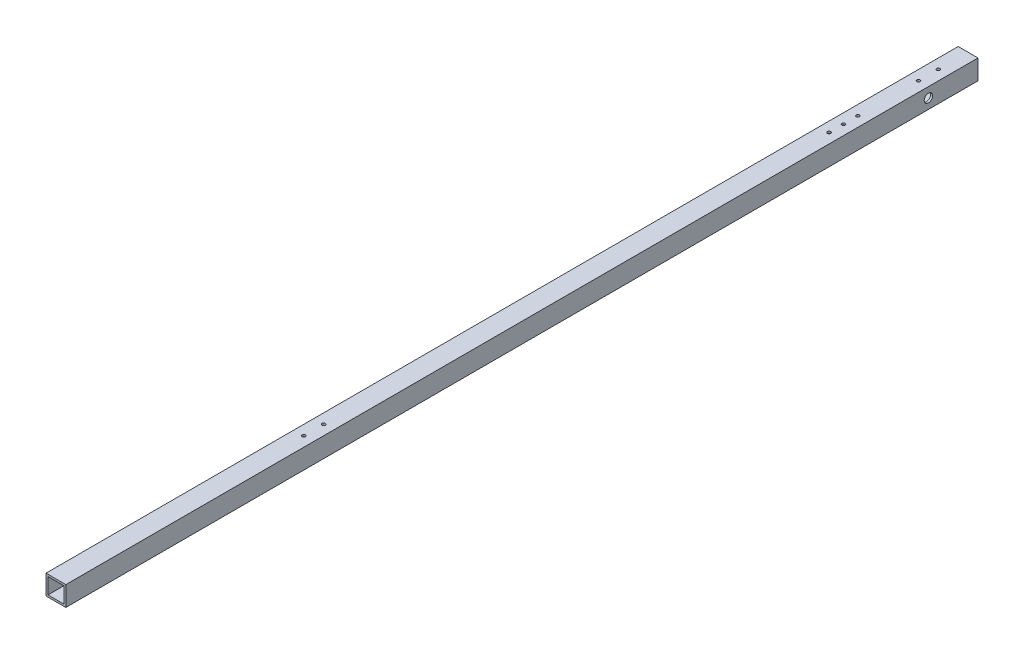
ISO-10303-21;
HEADER;
FILE_DESCRIPTION(('STEP AP214'),'2;1');
FILE_NAME('part.step','',(''),(''),'','','');
FILE_SCHEMA(('AUTOMOTIVE_DESIGN { 1 0 10303 214 1 1 1 1 }'));
ENDSEC;
DATA;
#1=APPLICATION_CONTEXT('core data for automotive mechanical design processes');
#2=APPLICATION_PROTOCOL_DEFINITION('international standard','automotive_design',2000,#1);
#3=PRODUCT_CONTEXT('',#1,'mechanical');
#4=PRODUCT('Part','Part','',(#3));
#5=PRODUCT_RELATED_PRODUCT_CATEGORY('part','',(#4));
#6=PRODUCT_DEFINITION_FORMATION('','',#4);
#7=PRODUCT_DEFINITION_CONTEXT('part definition',#1,'design');
#8=PRODUCT_DEFINITION('design','',#6,#7);
#9=PRODUCT_DEFINITION_SHAPE('','',#8);
#10=(LENGTH_UNIT() NAMED_UNIT(*) SI_UNIT(.MILLI.,.METRE.));
#11=(NAMED_UNIT(*) PLANE_ANGLE_UNIT() SI_UNIT($,.RADIAN.));
#12=(NAMED_UNIT(*) SI_UNIT($,.STERADIAN.) SOLID_ANGLE_UNIT());
#13=UNCERTAINTY_MEASURE_WITH_UNIT(LENGTH_MEASURE(1.E-05),#10,'distance_accuracy_value','');
#14=(GEOMETRIC_REPRESENTATION_CONTEXT(3) GLOBAL_UNCERTAINTY_ASSIGNED_CONTEXT((#13)) GLOBAL_UNIT_ASSIGNED_CONTEXT((#10,
#11,#12)) REPRESENTATION_CONTEXT('',''));
#15=CARTESIAN_POINT('',(0.,0.,0.));
#16=DIRECTION('',(0.,0.,1.));
#17=DIRECTION('',(1.,0.,0.));
#18=AXIS2_PLACEMENT_3D('',#15,#16,#17);
#19=CARTESIAN_POINT('',(-10.,10.,970.));
#20=DIRECTION('',(1.,0.,0.));
#21=DIRECTION('',(0.,0.,-1.));
#22=AXIS2_PLACEMENT_3D('',#19,#20,#21);
#23=PLANE('',#22);
#24=CARTESIAN_POINT('',(-10.,0.,730.));
#25=DIRECTION('',(-1.,0.,0.));
#26=DIRECTION('',(0.,0.,1.));
#27=AXIS2_PLACEMENT_3D('',#24,#25,#26);
#28=CIRCLE('',#27,1.64999999999999);
#29=CARTESIAN_POINT('',(-10.,0.,731.65));
#30=VERTEX_POINT('',#29);
#31=EDGE_CURVE('E362',#30,#30,#28,.T.);
#32=ORIENTED_EDGE('',*,*,#31,.F.);
#33=EDGE_LOOP('',(#32));
#34=FACE_BOUND('',#33,.T.);
#35=CARTESIAN_POINT('',(-10.,0.,710.));
#36=DIRECTION('',(-1.,0.,0.));
#37=DIRECTION('',(0.,0.,1.));
#38=AXIS2_PLACEMENT_3D('',#35,#36,#37);
#39=CIRCLE('',#38,1.64999999999999);
#40=CARTESIAN_POINT('',(-10.,0.,711.65));
#41=VERTEX_POINT('',#40);
#42=EDGE_CURVE('E356',#41,#41,#39,.T.);
#43=ORIENTED_EDGE('',*,*,#42,.F.);
#44=EDGE_LOOP('',(#43));
#45=FACE_BOUND('',#44,.T.);
#46=DIRECTION('',(0.,-1.,0.));
#47=VECTOR('',#46,1.);
#48=CARTESIAN_POINT('',(-10.,10.,920.));
#49=LINE('',#48,#47);
#50=CARTESIAN_POINT('',(-10.,10.,920.));
#51=VERTEX_POINT('',#50);
#52=CARTESIAN_POINT('',(-10.,-10.,920.));
#53=VERTEX_POINT('',#52);
#54=EDGE_CURVE('E60',#51,#53,#49,.T.);
#55=ORIENTED_EDGE('',*,*,#54,.F.);
#56=DIRECTION('',(0.,0.,-1.));
#57=VECTOR('',#56,1.);
#58=CARTESIAN_POINT('',(-10.,10.,970.));
#59=LINE('',#58,#57);
#60=CARTESIAN_POINT('',(-10.,10.,0.));
#61=VERTEX_POINT('',#60);
#62=EDGE_CURVE('E151',#51,#61,#59,.T.);
#63=ORIENTED_EDGE('',*,*,#62,.T.);
#64=DIRECTION('',(0.,-1.,0.));
#65=VECTOR('',#64,1.);
#66=CARTESIAN_POINT('',(-10.,10.,0.));
#67=LINE('',#66,#65);
#68=CARTESIAN_POINT('',(-10.,-10.,0.));
#69=VERTEX_POINT('',#68);
#70=EDGE_CURVE('E141',#61,#69,#67,.T.);
#71=ORIENTED_EDGE('',*,*,#70,.T.);
#72=DIRECTION('',(0.,0.,-1.));
#73=VECTOR('',#72,1.);
#74=CARTESIAN_POINT('',(-10.,-10.,970.));
#75=LINE('',#74,#73);
#76=EDGE_CURVE('E149',#53,#69,#75,.T.);
#77=ORIENTED_EDGE('',*,*,#76,.F.);
#78=EDGE_LOOP('',(#55,#63,#71,#77));
#79=FACE_BOUND('',#78,.T.);
#80=CARTESIAN_POINT('',(-10.,0.,49.9999999999999));
#81=DIRECTION('',(1.,0.,0.));
#82=DIRECTION('',(0.,0.,-1.));
#83=AXIS2_PLACEMENT_3D('',#80,#81,#82);
#84=CIRCLE('',#83,4.25000000000001);
#85=CARTESIAN_POINT('',(-10.,0.,45.7499999999999));
#86=VERTEX_POINT('',#85);
#87=EDGE_CURVE('E157',#86,#86,#84,.T.);
#88=ORIENTED_EDGE('',*,*,#87,.T.);
#89=EDGE_LOOP('',(#88));
#90=FACE_BOUND('',#89,.T.);
#91=CARTESIAN_POINT('',(-10.,0.,40.));
#92=DIRECTION('',(-1.,0.,0.));
#93=DIRECTION('',(0.,0.,1.));
#94=AXIS2_PLACEMENT_3D('',#91,#92,#93);
#95=CIRCLE('',#94,1.64999999999999);
#96=CARTESIAN_POINT('',(-10.,0.,41.65));
#97=VERTEX_POINT('',#96);
#98=EDGE_CURVE('E353',#97,#97,#95,.T.);
#99=ORIENTED_EDGE('',*,*,#98,.F.);
#100=EDGE_LOOP('',(#99));
#101=FACE_BOUND('',#100,.T.);
#102=ADVANCED_FACE('F43',(#34,#45,#79,#90,#101),#23,.F.);
#103=CARTESIAN_POINT('',(10.,10.,970.));
#104=DIRECTION('',(-1.,0.,0.));
#105=DIRECTION('',(0.,0.,1.));
#106=AXIS2_PLACEMENT_3D('',#103,#104,#105);
#107=PLANE('',#106);
#108=CARTESIAN_POINT('',(10.,0.,49.9999999999999));
#109=DIRECTION('',(1.,0.,0.));
#110=DIRECTION('',(0.,0.,-1.));
#111=AXIS2_PLACEMENT_3D('',#108,#109,#110);
#112=CIRCLE('',#111,4.25000000000001);
#113=CARTESIAN_POINT('',(10.,0.,45.7499999999999));
#114=VERTEX_POINT('',#113);
#115=EDGE_CURVE('E228',#114,#114,#112,.T.);
#116=ORIENTED_EDGE('',*,*,#115,.F.);
#117=EDGE_LOOP('',(#116));
#118=FACE_BOUND('',#117,.T.);
#119=DIRECTION('',(0.,1.,0.));
#120=VECTOR('',#119,1.);
#121=CARTESIAN_POINT('',(10.,10.,920.));
#122=LINE('',#121,#120);
#123=CARTESIAN_POINT('',(10.,-10.,920.));
#124=VERTEX_POINT('',#123);
#125=CARTESIAN_POINT('',(10.,10.,920.));
#126=VERTEX_POINT('',#125);
#127=EDGE_CURVE('E226',#124,#126,#122,.T.);
#128=ORIENTED_EDGE('',*,*,#127,.F.);
#129=DIRECTION('',(0.,0.,-1.));
#130=VECTOR('',#129,1.);
#131=CARTESIAN_POINT('',(10.,-10.,970.));
#132=LINE('',#131,#130);
#133=CARTESIAN_POINT('',(10.,-10.,0.));
#134=VERTEX_POINT('',#133);
#135=EDGE_CURVE('E147',#124,#134,#132,.T.);
#136=ORIENTED_EDGE('',*,*,#135,.T.);
#137=DIRECTION('',(0.,1.,0.));
#138=VECTOR('',#137,1.);
#139=CARTESIAN_POINT('',(10.,10.,0.));
#140=LINE('',#139,#138);
#141=CARTESIAN_POINT('',(10.,10.,0.));
#142=VERTEX_POINT('',#141);
#143=EDGE_CURVE('E135',#134,#142,#140,.T.);
#144=ORIENTED_EDGE('',*,*,#143,.T.);
#145=DIRECTION('',(0.,0.,-1.));
#146=VECTOR('',#145,1.);
#147=CARTESIAN_POINT('',(10.,10.,970.));
#148=LINE('',#147,#146);
#149=EDGE_CURVE('E52',#126,#142,#148,.T.);
#150=ORIENTED_EDGE('',*,*,#149,.F.);
#151=EDGE_LOOP('',(#128,#136,#144,#150));
#152=FACE_BOUND('',#151,.T.);
#153=ADVANCED_FACE('F45',(#118,#152),#107,.F.);
#154=CARTESIAN_POINT('',(-10.,10.,970.));
#155=DIRECTION('',(0.,-1.,0.));
#156=DIRECTION('',(1.,0.,0.));
#157=AXIS2_PLACEMENT_3D('',#154,#155,#156);
#158=PLANE('',#157);
#159=CARTESIAN_POINT('',(0.,10.,30.));
#160=DIRECTION('',(0.,1.,0.));
#161=DIRECTION('',(0.,0.,1.));
#162=AXIS2_PLACEMENT_3D('',#159,#160,#161);
#163=CIRCLE('',#162,1.64999999999999);
#164=CARTESIAN_POINT('',(0.,10.,31.65));
#165=VERTEX_POINT('',#164);
#166=EDGE_CURVE('E186',#165,#165,#163,.T.);
#167=ORIENTED_EDGE('',*,*,#166,.F.);
#168=EDGE_LOOP('',(#167));
#169=FACE_BOUND('',#168,.T.);
#170=CARTESIAN_POINT('',(0.,10.,50.));
#171=DIRECTION('',(0.,1.,0.));
#172=DIRECTION('',(0.,0.,1.));
#173=AXIS2_PLACEMENT_3D('',#170,#171,#172);
#174=CIRCLE('',#173,1.64999999999999);
#175=CARTESIAN_POINT('',(0.,10.,51.65));
#176=VERTEX_POINT('',#175);
#177=EDGE_CURVE('E175',#176,#176,#174,.T.);
#178=ORIENTED_EDGE('',*,*,#177,.F.);
#179=EDGE_LOOP('',(#178));
#180=FACE_BOUND('',#179,.T.);
#181=CARTESIAN_POINT('',(0.,10.,650.));
#182=DIRECTION('',(0.,1.,0.));
#183=DIRECTION('',(0.,0.,1.));
#184=AXIS2_PLACEMENT_3D('',#181,#182,#183);
#185=CIRCLE('',#184,1.64999999999999);
#186=CARTESIAN_POINT('',(0.,10.,651.65));
#187=VERTEX_POINT('',#186);
#188=EDGE_CURVE('E174',#187,#187,#185,.T.);
#189=ORIENTED_EDGE('',*,*,#188,.F.);
#190=EDGE_LOOP('',(#189));
#191=FACE_BOUND('',#190,.T.);
#192=CARTESIAN_POINT('',(0.,10.,670.));
#193=DIRECTION('',(0.,1.,0.));
#194=DIRECTION('',(0.,0.,1.));
#195=AXIS2_PLACEMENT_3D('',#192,#193,#194);
#196=CIRCLE('',#195,1.64999999999999);
#197=CARTESIAN_POINT('',(0.,10.,671.65));
#198=VERTEX_POINT('',#197);
#199=EDGE_CURVE('E171',#198,#198,#196,.T.);
#200=ORIENTED_EDGE('',*,*,#199,.F.);
#201=EDGE_LOOP('',(#200));
#202=FACE_BOUND('',#201,.T.);
#203=CARTESIAN_POINT('',(0.,10.,125.71));
#204=DIRECTION('',(0.,1.,0.));
#205=DIRECTION('',(0.,0.,1.));
#206=AXIS2_PLACEMENT_3D('',#203,#204,#205);
#207=CIRCLE('',#206,1.64999999999999);
#208=CARTESIAN_POINT('',(0.,10.,127.36));
#209=VERTEX_POINT('',#208);
#210=EDGE_CURVE('E170',#209,#209,#207,.T.);
#211=ORIENTED_EDGE('',*,*,#210,.F.);
#212=EDGE_LOOP('',(#211));
#213=FACE_BOUND('',#212,.T.);
#214=CARTESIAN_POINT('',(0.,10.,111.21));
#215=DIRECTION('',(0.,1.,0.));
#216=DIRECTION('',(0.,0.,1.));
#217=AXIS2_PLACEMENT_3D('',#214,#215,#216);
#218=CIRCLE('',#217,1.64999999999999);
#219=CARTESIAN_POINT('',(0.,10.,112.86));
#220=VERTEX_POINT('',#219);
#221=EDGE_CURVE('E205',#220,#220,#218,.T.);
#222=ORIENTED_EDGE('',*,*,#221,.F.);
#223=EDGE_LOOP('',(#222));
#224=FACE_BOUND('',#223,.T.);
#225=CARTESIAN_POINT('',(0.,10.,140.21));
#226=DIRECTION('',(0.,1.,0.));
#227=DIRECTION('',(0.,0.,1.));
#228=AXIS2_PLACEMENT_3D('',#225,#226,#227);
#229=CIRCLE('',#228,1.64999999999999);
#230=CARTESIAN_POINT('',(0.,10.,141.86));
#231=VERTEX_POINT('',#230);
#232=EDGE_CURVE('E212',#231,#231,#229,.T.);
#233=ORIENTED_EDGE('',*,*,#232,.F.);
#234=EDGE_LOOP('',(#233));
#235=FACE_BOUND('',#234,.T.);
#236=DIRECTION('',(-1.,0.,0.));
#237=VECTOR('',#236,1.);
#238=CARTESIAN_POINT('',(-10.,10.,920.));
#239=LINE('',#238,#237);
#240=EDGE_CURVE('E224',#126,#51,#239,.T.);
#241=ORIENTED_EDGE('',*,*,#240,.F.);
#242=ORIENTED_EDGE('',*,*,#149,.T.);
#243=DIRECTION('',(-1.,0.,0.));
#244=VECTOR('',#243,1.);
#245=CARTESIAN_POINT('',(-10.,10.,0.));
#246=LINE('',#245,#244);
#247=EDGE_CURVE('E138',#142,#61,#246,.T.);
#248=ORIENTED_EDGE('',*,*,#247,.T.);
#249=ORIENTED_EDGE('',*,*,#62,.F.);
#250=EDGE_LOOP('',(#241,#242,#248,#249));
#251=FACE_BOUND('',#250,.T.);
#252=ADVANCED_FACE('F261',(#169,#180,#191,#202,#213,#224,#235,#251),#158,.F.);
#253=CARTESIAN_POINT('',(-10.,-10.,970.));
#254=DIRECTION('',(0.,1.,0.));
#255=DIRECTION('',(0.,0.,1.));
#256=AXIS2_PLACEMENT_3D('',#253,#254,#255);
#257=PLANE('',#256);
#258=CARTESIAN_POINT('',(0.,-10.,125.71));
#259=DIRECTION('',(0.,1.,0.));
#260=DIRECTION('',(0.,0.,1.));
#261=AXIS2_PLACEMENT_3D('',#258,#259,#260);
#262=CIRCLE('',#261,1.65);
#263=CARTESIAN_POINT('',(0.,-10.,127.36));
#264=VERTEX_POINT('',#263);
#265=EDGE_CURVE('E196',#264,#264,#262,.T.);
#266=ORIENTED_EDGE('',*,*,#265,.T.);
#267=EDGE_LOOP('',(#266));
#268=FACE_BOUND('',#267,.T.);
#269=CARTESIAN_POINT('',(0.,-10.,111.21));
#270=DIRECTION('',(0.,1.,0.));
#271=DIRECTION('',(0.,0.,1.));
#272=AXIS2_PLACEMENT_3D('',#269,#270,#271);
#273=CIRCLE('',#272,1.65);
#274=CARTESIAN_POINT('',(0.,-10.,112.86));
#275=VERTEX_POINT('',#274);
#276=EDGE_CURVE('E167',#275,#275,#273,.T.);
#277=ORIENTED_EDGE('',*,*,#276,.T.);
#278=EDGE_LOOP('',(#277));
#279=FACE_BOUND('',#278,.T.);
#280=CARTESIAN_POINT('',(0.,-10.,140.21));
#281=DIRECTION('',(0.,1.,0.));
#282=DIRECTION('',(0.,0.,1.));
#283=AXIS2_PLACEMENT_3D('',#280,#281,#282);
#284=CIRCLE('',#283,1.65);
#285=CARTESIAN_POINT('',(0.,-10.,141.86));
#286=VERTEX_POINT('',#285);
#287=EDGE_CURVE('E162',#286,#286,#284,.T.);
#288=ORIENTED_EDGE('',*,*,#287,.T.);
#289=EDGE_LOOP('',(#288));
#290=FACE_BOUND('',#289,.T.);
#291=DIRECTION('',(1.,0.,0.));
#292=VECTOR('',#291,1.);
#293=CARTESIAN_POINT('',(-10.,-10.,920.));
#294=LINE('',#293,#292);
#295=EDGE_CURVE('E221',#53,#124,#294,.T.);
#296=ORIENTED_EDGE('',*,*,#295,.F.);
#297=ORIENTED_EDGE('',*,*,#76,.T.);
#298=DIRECTION('',(1.,0.,0.));
#299=VECTOR('',#298,1.);
#300=CARTESIAN_POINT('',(-10.,-10.,0.));
#301=LINE('',#300,#299);
#302=EDGE_CURVE('E144',#69,#134,#301,.T.);
#303=ORIENTED_EDGE('',*,*,#302,.T.);
#304=ORIENTED_EDGE('',*,*,#135,.F.);
#305=EDGE_LOOP('',(#296,#297,#303,#304));
#306=FACE_BOUND('',#305,.T.);
#307=ADVANCED_FACE('F252',(#268,#279,#290,#306),#257,.F.);
#308=CARTESIAN_POINT('',(8.,8.,970.));
#309=DIRECTION('',(-1.,0.,0.));
#310=DIRECTION('',(0.,-1.,0.));
#311=AXIS2_PLACEMENT_3D('',#308,#309,#310);
#312=PLANE('',#311);
#313=CARTESIAN_POINT('',(8.,0.,49.9999999999999));
#314=DIRECTION('',(-1.,0.,0.));
#315=DIRECTION('',(0.,-1.,0.));
#316=AXIS2_PLACEMENT_3D('',#313,#314,#315);
#317=CIRCLE('',#316,4.25000000000001);
#318=CARTESIAN_POINT('',(8.,-4.25000000000001,49.9999999999999));
#319=VERTEX_POINT('',#318);
#320=EDGE_CURVE('E156',#319,#319,#317,.T.);
#321=ORIENTED_EDGE('',*,*,#320,.F.);
#322=EDGE_LOOP('',(#321));
#323=FACE_BOUND('',#322,.T.);
#324=DIRECTION('',(0.,0.,-1.));
#325=VECTOR('',#324,1.);
#326=CARTESIAN_POINT('',(8.,-8.,970.));
#327=LINE('',#326,#325);
#328=CARTESIAN_POINT('',(8.,-8.,920.));
#329=VERTEX_POINT('',#328);
#330=CARTESIAN_POINT('',(8.,-8.,0.));
#331=VERTEX_POINT('',#330);
#332=EDGE_CURVE('E127',#329,#331,#327,.T.);
#333=ORIENTED_EDGE('',*,*,#332,.F.);
#334=DIRECTION('',(0.,1.,0.));
#335=VECTOR('',#334,1.);
#336=CARTESIAN_POINT('',(8.,8.,920.));
#337=LINE('',#336,#335);
#338=CARTESIAN_POINT('',(8.,8.,920.));
#339=VERTEX_POINT('',#338);
#340=EDGE_CURVE('E68',#329,#339,#337,.T.);
#341=ORIENTED_EDGE('',*,*,#340,.T.);
#342=DIRECTION('',(0.,0.,-1.));
#343=VECTOR('',#342,1.);
#344=CARTESIAN_POINT('',(8.,8.,970.));
#345=LINE('',#344,#343);
#346=CARTESIAN_POINT('',(8.,8.,0.));
#347=VERTEX_POINT('',#346);
#348=EDGE_CURVE('E129',#339,#347,#345,.T.);
#349=ORIENTED_EDGE('',*,*,#348,.T.);
#350=DIRECTION('',(0.,1.,0.));
#351=VECTOR('',#350,1.);
#352=CARTESIAN_POINT('',(8.,8.,0.));
#353=LINE('',#352,#351);
#354=EDGE_CURVE('E235',#331,#347,#353,.T.);
#355=ORIENTED_EDGE('',*,*,#354,.F.);
#356=EDGE_LOOP('',(#333,#341,#349,#355));
#357=FACE_BOUND('',#356,.T.);
#358=ADVANCED_FACE('F250',(#323,#357),#312,.T.);
#359=CARTESIAN_POINT('',(-8.,8.,970.));
#360=DIRECTION('',(0.,-1.,0.));
#361=DIRECTION('',(0.,0.,-1.));
#362=AXIS2_PLACEMENT_3D('',#359,#360,#361);
#363=PLANE('',#362);
#364=CARTESIAN_POINT('',(0.,8.,30.));
#365=DIRECTION('',(0.,-1.,0.));
#366=DIRECTION('',(0.,0.,-1.));
#367=AXIS2_PLACEMENT_3D('',#364,#365,#366);
#368=CIRCLE('',#367,1.64999999999999);
#369=CARTESIAN_POINT('',(0.,8.,28.35));
#370=VERTEX_POINT('',#369);
#371=EDGE_CURVE('E47',#370,#370,#368,.T.);
#372=ORIENTED_EDGE('',*,*,#371,.F.);
#373=EDGE_LOOP('',(#372));
#374=FACE_BOUND('',#373,.T.);
#375=CARTESIAN_POINT('',(0.,8.,50.));
#376=DIRECTION('',(0.,-1.,0.));
#377=DIRECTION('',(0.,0.,-1.));
#378=AXIS2_PLACEMENT_3D('',#375,#376,#377);
#379=CIRCLE('',#378,1.64999999999999);
#380=CARTESIAN_POINT('',(0.,8.,48.35));
#381=VERTEX_POINT('',#380);
#382=EDGE_CURVE('E172',#381,#381,#379,.T.);
#383=ORIENTED_EDGE('',*,*,#382,.F.);
#384=EDGE_LOOP('',(#383));
#385=FACE_BOUND('',#384,.T.);
#386=CARTESIAN_POINT('',(0.,8.,650.));
#387=DIRECTION('',(0.,-1.,0.));
#388=DIRECTION('',(0.,0.,-1.));
#389=AXIS2_PLACEMENT_3D('',#386,#387,#388);
#390=CIRCLE('',#389,1.64999999999999);
#391=CARTESIAN_POINT('',(0.,8.,648.35));
#392=VERTEX_POINT('',#391);
#393=EDGE_CURVE('E179',#392,#392,#390,.T.);
#394=ORIENTED_EDGE('',*,*,#393,.F.);
#395=EDGE_LOOP('',(#394));
#396=FACE_BOUND('',#395,.T.);
#397=CARTESIAN_POINT('',(0.,8.,670.));
#398=DIRECTION('',(0.,-1.,0.));
#399=DIRECTION('',(0.,0.,-1.));
#400=AXIS2_PLACEMENT_3D('',#397,#398,#399);
#401=CIRCLE('',#400,1.64999999999999);
#402=CARTESIAN_POINT('',(0.,8.,668.35));
#403=VERTEX_POINT('',#402);
#404=EDGE_CURVE('E168',#403,#403,#401,.T.);
#405=ORIENTED_EDGE('',*,*,#404,.F.);
#406=EDGE_LOOP('',(#405));
#407=FACE_BOUND('',#406,.T.);
#408=CARTESIAN_POINT('',(0.,8.,125.71));
#409=DIRECTION('',(0.,-1.,0.));
#410=DIRECTION('',(0.,0.,-1.));
#411=AXIS2_PLACEMENT_3D('',#408,#409,#410);
#412=CIRCLE('',#411,1.64999999999999);
#413=CARTESIAN_POINT('',(0.,8.,124.06));
#414=VERTEX_POINT('',#413);
#415=EDGE_CURVE('E202',#414,#414,#412,.T.);
#416=ORIENTED_EDGE('',*,*,#415,.F.);
#417=EDGE_LOOP('',(#416));
#418=FACE_BOUND('',#417,.T.);
#419=CARTESIAN_POINT('',(0.,8.,111.21));
#420=DIRECTION('',(0.,-1.,0.));
#421=DIRECTION('',(0.,0.,-1.));
#422=AXIS2_PLACEMENT_3D('',#419,#420,#421);
#423=CIRCLE('',#422,1.64999999999999);
#424=CARTESIAN_POINT('',(0.,8.,109.56));
#425=VERTEX_POINT('',#424);
#426=EDGE_CURVE('E163',#425,#425,#423,.T.);
#427=ORIENTED_EDGE('',*,*,#426,.F.);
#428=EDGE_LOOP('',(#427));
#429=FACE_BOUND('',#428,.T.);
#430=CARTESIAN_POINT('',(0.,8.,140.21));
#431=DIRECTION('',(0.,-1.,0.));
#432=DIRECTION('',(0.,0.,-1.));
#433=AXIS2_PLACEMENT_3D('',#430,#431,#432);
#434=CIRCLE('',#433,1.64999999999999);
#435=CARTESIAN_POINT('',(0.,8.,138.56));
#436=VERTEX_POINT('',#435);
#437=EDGE_CURVE('E159',#436,#436,#434,.T.);
#438=ORIENTED_EDGE('',*,*,#437,.F.);
#439=EDGE_LOOP('',(#438));
#440=FACE_BOUND('',#439,.T.);
#441=ORIENTED_EDGE('',*,*,#348,.F.);
#442=DIRECTION('',(-1.,0.,0.));
#443=VECTOR('',#442,1.);
#444=CARTESIAN_POINT('',(-8.,8.,920.));
#445=LINE('',#444,#443);
#446=CARTESIAN_POINT('',(-8.,8.,920.));
#447=VERTEX_POINT('',#446);
#448=EDGE_CURVE('E120',#339,#447,#445,.T.);
#449=ORIENTED_EDGE('',*,*,#448,.T.);
#450=DIRECTION('',(0.,0.,-1.));
#451=VECTOR('',#450,1.);
#452=CARTESIAN_POINT('',(-8.,8.,970.));
#453=LINE('',#452,#451);
#454=CARTESIAN_POINT('',(-8.,8.,0.));
#455=VERTEX_POINT('',#454);
#456=EDGE_CURVE('E119',#447,#455,#453,.T.);
#457=ORIENTED_EDGE('',*,*,#456,.T.);
#458=DIRECTION('',(-1.,0.,0.));
#459=VECTOR('',#458,1.);
#460=CARTESIAN_POINT('',(-8.,8.,0.));
#461=LINE('',#460,#459);
#462=EDGE_CURVE('E238',#347,#455,#461,.T.);
#463=ORIENTED_EDGE('',*,*,#462,.F.);
#464=EDGE_LOOP('',(#441,#449,#457,#463));
#465=FACE_BOUND('',#464,.T.);
#466=ADVANCED_FACE('F248',(#374,#385,#396,#407,#418,#429,#440,#465),#363,.T.);
#467=CARTESIAN_POINT('',(-8.,8.,970.));
#468=DIRECTION('',(1.,0.,0.));
#469=DIRECTION('',(0.,0.,-1.));
#470=AXIS2_PLACEMENT_3D('',#467,#468,#469);
#471=PLANE('',#470);
#472=CARTESIAN_POINT('',(-8.,0.,730.));
#473=DIRECTION('',(1.,0.,0.));
#474=DIRECTION('',(0.,0.,-1.));
#475=AXIS2_PLACEMENT_3D('',#472,#473,#474);
#476=CIRCLE('',#475,1.64999999999999);
#477=CARTESIAN_POINT('',(-8.,0.,728.35));
#478=VERTEX_POINT('',#477);
#479=EDGE_CURVE('E338',#478,#478,#476,.T.);
#480=ORIENTED_EDGE('',*,*,#479,.F.);
#481=EDGE_LOOP('',(#480));
#482=FACE_BOUND('',#481,.T.);
#483=CARTESIAN_POINT('',(-8.,0.,710.));
#484=DIRECTION('',(1.,0.,0.));
#485=DIRECTION('',(0.,0.,-1.));
#486=AXIS2_PLACEMENT_3D('',#483,#484,#485);
#487=CIRCLE('',#486,1.64999999999999);
#488=CARTESIAN_POINT('',(-8.,0.,708.35));
#489=VERTEX_POINT('',#488);
#490=EDGE_CURVE('E342',#489,#489,#487,.T.);
#491=ORIENTED_EDGE('',*,*,#490,.F.);
#492=EDGE_LOOP('',(#491));
#493=FACE_BOUND('',#492,.T.);
#494=CARTESIAN_POINT('',(-8.,0.,40.));
#495=DIRECTION('',(1.,0.,0.));
#496=DIRECTION('',(0.,0.,-1.));
#497=AXIS2_PLACEMENT_3D('',#494,#495,#496);
#498=CIRCLE('',#497,1.64999999999999);
#499=CARTESIAN_POINT('',(-8.,0.,38.35));
#500=VERTEX_POINT('',#499);
#501=EDGE_CURVE('E346',#500,#500,#498,.T.);
#502=ORIENTED_EDGE('',*,*,#501,.F.);
#503=EDGE_LOOP('',(#502));
#504=FACE_BOUND('',#503,.T.);
#505=CARTESIAN_POINT('',(-8.,0.,49.9999999999999));
#506=DIRECTION('',(1.,0.,0.));
#507=DIRECTION('',(0.,0.,-1.));
#508=AXIS2_PLACEMENT_3D('',#505,#506,#507);
#509=CIRCLE('',#508,4.25000000000001);
#510=CARTESIAN_POINT('',(-8.,0.,45.7499999999999));
#511=VERTEX_POINT('',#510);
#512=EDGE_CURVE('E154',#511,#511,#509,.T.);
#513=ORIENTED_EDGE('',*,*,#512,.F.);
#514=EDGE_LOOP('',(#513));
#515=FACE_BOUND('',#514,.T.);
#516=ORIENTED_EDGE('',*,*,#456,.F.);
#517=DIRECTION('',(0.,-1.,0.));
#518=VECTOR('',#517,1.);
#519=CARTESIAN_POINT('',(-8.,8.,920.));
#520=LINE('',#519,#518);
#521=CARTESIAN_POINT('',(-8.,-8.,920.));
#522=VERTEX_POINT('',#521);
#523=EDGE_CURVE('E108',#447,#522,#520,.T.);
#524=ORIENTED_EDGE('',*,*,#523,.T.);
#525=DIRECTION('',(0.,0.,-1.));
#526=VECTOR('',#525,1.);
#527=CARTESIAN_POINT('',(-8.,-8.,970.));
#528=LINE('',#527,#526);
#529=CARTESIAN_POINT('',(-8.,-8.,0.));
#530=VERTEX_POINT('',#529);
#531=EDGE_CURVE('E117',#522,#530,#528,.T.);
#532=ORIENTED_EDGE('',*,*,#531,.T.);
#533=DIRECTION('',(0.,-1.,0.));
#534=VECTOR('',#533,1.);
#535=CARTESIAN_POINT('',(-8.,8.,0.));
#536=LINE('',#535,#534);
#537=EDGE_CURVE('E241',#455,#530,#536,.T.);
#538=ORIENTED_EDGE('',*,*,#537,.F.);
#539=EDGE_LOOP('',(#516,#524,#532,#538));
#540=FACE_BOUND('',#539,.T.);
#541=ADVANCED_FACE('F115',(#482,#493,#504,#515,#540),#471,.T.);
#542=CARTESIAN_POINT('',(-8.,-8.,970.));
#543=DIRECTION('',(0.,1.,0.));
#544=DIRECTION('',(0.,0.,1.));
#545=AXIS2_PLACEMENT_3D('',#542,#543,#544);
#546=PLANE('',#545);
#547=CARTESIAN_POINT('',(0.,-8.,125.71));
#548=DIRECTION('',(0.,1.,0.));
#549=DIRECTION('',(0.,0.,1.));
#550=AXIS2_PLACEMENT_3D('',#547,#548,#549);
#551=CIRCLE('',#550,1.64999999999999);
#552=CARTESIAN_POINT('',(0.,-8.,127.36));
#553=VERTEX_POINT('',#552);
#554=EDGE_CURVE('E199',#553,#553,#551,.T.);
#555=ORIENTED_EDGE('',*,*,#554,.F.);
#556=EDGE_LOOP('',(#555));
#557=FACE_BOUND('',#556,.T.);
#558=CARTESIAN_POINT('',(0.,-8.,111.21));
#559=DIRECTION('',(0.,1.,0.));
#560=DIRECTION('',(0.,0.,1.));
#561=AXIS2_PLACEMENT_3D('',#558,#559,#560);
#562=CIRCLE('',#561,1.64999999999999);
#563=CARTESIAN_POINT('',(0.,-8.,112.86));
#564=VERTEX_POINT('',#563);
#565=EDGE_CURVE('E166',#564,#564,#562,.T.);
#566=ORIENTED_EDGE('',*,*,#565,.F.);
#567=EDGE_LOOP('',(#566));
#568=FACE_BOUND('',#567,.T.);
#569=CARTESIAN_POINT('',(0.,-8.,140.21));
#570=DIRECTION('',(0.,1.,0.));
#571=DIRECTION('',(0.,0.,1.));
#572=AXIS2_PLACEMENT_3D('',#569,#570,#571);
#573=CIRCLE('',#572,1.64999999999999);
#574=CARTESIAN_POINT('',(0.,-8.,141.86));
#575=VERTEX_POINT('',#574);
#576=EDGE_CURVE('E121',#575,#575,#573,.T.);
#577=ORIENTED_EDGE('',*,*,#576,.F.);
#578=EDGE_LOOP('',(#577));
#579=FACE_BOUND('',#578,.T.);
#580=ORIENTED_EDGE('',*,*,#531,.F.);
#581=DIRECTION('',(1.,0.,0.));
#582=VECTOR('',#581,1.);
#583=CARTESIAN_POINT('',(-8.,-8.,920.));
#584=LINE('',#583,#582);
#585=EDGE_CURVE('E12',#522,#329,#584,.T.);
#586=ORIENTED_EDGE('',*,*,#585,.T.);
#587=ORIENTED_EDGE('',*,*,#332,.T.);
#588=DIRECTION('',(1.,0.,0.));
#589=VECTOR('',#588,1.);
#590=CARTESIAN_POINT('',(-8.,-8.,0.));
#591=LINE('',#590,#589);
#592=EDGE_CURVE('E125',#530,#331,#591,.T.);
#593=ORIENTED_EDGE('',*,*,#592,.F.);
#594=EDGE_LOOP('',(#580,#586,#587,#593));
#595=FACE_BOUND('',#594,.T.);
#596=ADVANCED_FACE('F123',(#557,#568,#579,#595),#546,.T.);
#597=CARTESIAN_POINT('',(0.,0.,0.));
#598=DIRECTION('',(0.,0.,1.));
#599=DIRECTION('',(1.,0.,0.));
#600=AXIS2_PLACEMENT_3D('',#597,#598,#599);
#601=PLANE('',#600);
#602=ORIENTED_EDGE('',*,*,#143,.F.);
#603=ORIENTED_EDGE('',*,*,#302,.F.);
#604=ORIENTED_EDGE('',*,*,#70,.F.);
#605=ORIENTED_EDGE('',*,*,#247,.F.);
#606=EDGE_LOOP('',(#602,#603,#604,#605));
#607=FACE_BOUND('',#606,.T.);
#608=ORIENTED_EDGE('',*,*,#354,.T.);
#609=ORIENTED_EDGE('',*,*,#462,.T.);
#610=ORIENTED_EDGE('',*,*,#537,.T.);
#611=ORIENTED_EDGE('',*,*,#592,.T.);
#612=EDGE_LOOP('',(#608,#609,#610,#611));
#613=FACE_BOUND('',#612,.T.);
#614=ADVANCED_FACE('F243',(#607,#613),#601,.F.);
#615=CARTESIAN_POINT('',(-10.,0.,49.9999999999999));
#616=DIRECTION('',(1.,0.,0.));
#617=DIRECTION('',(0.,0.,-1.));
#618=AXIS2_PLACEMENT_3D('',#615,#616,#617);
#619=CYLINDRICAL_SURFACE('',#618,4.25000000000001);
#620=ORIENTED_EDGE('',*,*,#512,.T.);
#621=EDGE_LOOP('',(#620));
#622=FACE_BOUND('',#621,.T.);
#623=ORIENTED_EDGE('',*,*,#87,.F.);
#624=EDGE_LOOP('',(#623));
#625=FACE_BOUND('',#624,.T.);
#626=ADVANCED_FACE('F321',(#622,#625),#619,.F.);
#627=ORIENTED_EDGE('',*,*,#320,.T.);
#628=EDGE_LOOP('',(#627));
#629=FACE_BOUND('',#628,.T.);
#630=ORIENTED_EDGE('',*,*,#115,.T.);
#631=EDGE_LOOP('',(#630));
#632=FACE_BOUND('',#631,.T.);
#633=ADVANCED_FACE('F312',(#629,#632),#619,.F.);
#634=CARTESIAN_POINT('',(0.,0.,920.));
#635=DIRECTION('',(0.,0.,1.));
#636=DIRECTION('',(1.,0.,0.));
#637=AXIS2_PLACEMENT_3D('',#634,#635,#636);
#638=PLANE('',#637);
#639=ORIENTED_EDGE('',*,*,#585,.F.);
#640=ORIENTED_EDGE('',*,*,#523,.F.);
#641=ORIENTED_EDGE('',*,*,#448,.F.);
#642=ORIENTED_EDGE('',*,*,#340,.F.);
#643=EDGE_LOOP('',(#639,#640,#641,#642));
#644=FACE_BOUND('',#643,.T.);
#645=ORIENTED_EDGE('',*,*,#127,.T.);
#646=ORIENTED_EDGE('',*,*,#240,.T.);
#647=ORIENTED_EDGE('',*,*,#54,.T.);
#648=ORIENTED_EDGE('',*,*,#295,.T.);
#649=EDGE_LOOP('',(#645,#646,#647,#648));
#650=FACE_BOUND('',#649,.T.);
#651=ADVANCED_FACE('F107',(#644,#650),#638,.T.);
#652=CARTESIAN_POINT('',(0.,10.,140.21));
#653=DIRECTION('',(0.,1.,0.));
#654=DIRECTION('',(0.,0.,1.));
#655=AXIS2_PLACEMENT_3D('',#652,#653,#654);
#656=CYLINDRICAL_SURFACE('',#655,1.64999999999999);
#657=ORIENTED_EDGE('',*,*,#437,.T.);
#658=EDGE_LOOP('',(#657));
#659=FACE_BOUND('',#658,.T.);
#660=ORIENTED_EDGE('',*,*,#232,.T.);
#661=EDGE_LOOP('',(#660));
#662=FACE_BOUND('',#661,.T.);
#663=ADVANCED_FACE('F311',(#659,#662),#656,.F.);
#664=ORIENTED_EDGE('',*,*,#576,.T.);
#665=EDGE_LOOP('',(#664));
#666=FACE_BOUND('',#665,.T.);
#667=ORIENTED_EDGE('',*,*,#287,.F.);
#668=EDGE_LOOP('',(#667));
#669=FACE_BOUND('',#668,.T.);
#670=ADVANCED_FACE('F318',(#666,#669),#656,.F.);
#671=CARTESIAN_POINT('',(0.,10.,111.21));
#672=DIRECTION('',(0.,1.,0.));
#673=DIRECTION('',(0.,0.,1.));
#674=AXIS2_PLACEMENT_3D('',#671,#672,#673);
#675=CYLINDRICAL_SURFACE('',#674,1.64999999999999);
#676=ORIENTED_EDGE('',*,*,#426,.T.);
#677=EDGE_LOOP('',(#676));
#678=FACE_BOUND('',#677,.T.);
#679=ORIENTED_EDGE('',*,*,#221,.T.);
#680=EDGE_LOOP('',(#679));
#681=FACE_BOUND('',#680,.T.);
#682=ADVANCED_FACE('F400',(#678,#681),#675,.F.);
#683=ORIENTED_EDGE('',*,*,#565,.T.);
#684=EDGE_LOOP('',(#683));
#685=FACE_BOUND('',#684,.T.);
#686=ORIENTED_EDGE('',*,*,#276,.F.);
#687=EDGE_LOOP('',(#686));
#688=FACE_BOUND('',#687,.T.);
#689=ADVANCED_FACE('F398',(#685,#688),#675,.F.);
#690=CARTESIAN_POINT('',(0.,10.,125.71));
#691=DIRECTION('',(0.,1.,0.));
#692=DIRECTION('',(0.,0.,1.));
#693=AXIS2_PLACEMENT_3D('',#690,#691,#692);
#694=CYLINDRICAL_SURFACE('',#693,1.64999999999999);
#695=ORIENTED_EDGE('',*,*,#554,.T.);
#696=EDGE_LOOP('',(#695));
#697=FACE_BOUND('',#696,.T.);
#698=ORIENTED_EDGE('',*,*,#265,.F.);
#699=EDGE_LOOP('',(#698));
#700=FACE_BOUND('',#699,.T.);
#701=ADVANCED_FACE('F396',(#697,#700),#694,.F.);
#702=ORIENTED_EDGE('',*,*,#415,.T.);
#703=EDGE_LOOP('',(#702));
#704=FACE_BOUND('',#703,.T.);
#705=ORIENTED_EDGE('',*,*,#210,.T.);
#706=EDGE_LOOP('',(#705));
#707=FACE_BOUND('',#706,.T.);
#708=ADVANCED_FACE('F394',(#704,#707),#694,.F.);
#709=CARTESIAN_POINT('',(0.,10.,670.));
#710=DIRECTION('',(0.,1.,0.));
#711=DIRECTION('',(0.,0.,1.));
#712=AXIS2_PLACEMENT_3D('',#709,#710,#711);
#713=CYLINDRICAL_SURFACE('',#712,1.64999999999999);
#714=ORIENTED_EDGE('',*,*,#404,.T.);
#715=EDGE_LOOP('',(#714));
#716=FACE_BOUND('',#715,.T.);
#717=ORIENTED_EDGE('',*,*,#199,.T.);
#718=EDGE_LOOP('',(#717));
#719=FACE_BOUND('',#718,.T.);
#720=ADVANCED_FACE('F390',(#716,#719),#713,.F.);
#721=CARTESIAN_POINT('',(0.,10.,650.));
#722=DIRECTION('',(0.,1.,0.));
#723=DIRECTION('',(0.,0.,1.));
#724=AXIS2_PLACEMENT_3D('',#721,#722,#723);
#725=CYLINDRICAL_SURFACE('',#724,1.64999999999999);
#726=ORIENTED_EDGE('',*,*,#393,.T.);
#727=EDGE_LOOP('',(#726));
#728=FACE_BOUND('',#727,.T.);
#729=ORIENTED_EDGE('',*,*,#188,.T.);
#730=EDGE_LOOP('',(#729));
#731=FACE_BOUND('',#730,.T.);
#732=ADVANCED_FACE('F387',(#728,#731),#725,.F.);
#733=CARTESIAN_POINT('',(0.,10.,50.));
#734=DIRECTION('',(0.,1.,0.));
#735=DIRECTION('',(0.,0.,1.));
#736=AXIS2_PLACEMENT_3D('',#733,#734,#735);
#737=CYLINDRICAL_SURFACE('',#736,1.64999999999999);
#738=ORIENTED_EDGE('',*,*,#382,.T.);
#739=EDGE_LOOP('',(#738));
#740=FACE_BOUND('',#739,.T.);
#741=ORIENTED_EDGE('',*,*,#177,.T.);
#742=EDGE_LOOP('',(#741));
#743=FACE_BOUND('',#742,.T.);
#744=ADVANCED_FACE('F383',(#740,#743),#737,.F.);
#745=CARTESIAN_POINT('',(0.,10.,30.));
#746=DIRECTION('',(0.,1.,0.));
#747=DIRECTION('',(0.,0.,1.));
#748=AXIS2_PLACEMENT_3D('',#745,#746,#747);
#749=CYLINDRICAL_SURFACE('',#748,1.64999999999999);
#750=ORIENTED_EDGE('',*,*,#371,.T.);
#751=EDGE_LOOP('',(#750));
#752=FACE_BOUND('',#751,.T.);
#753=ORIENTED_EDGE('',*,*,#166,.T.);
#754=EDGE_LOOP('',(#753));
#755=FACE_BOUND('',#754,.T.);
#756=ADVANCED_FACE('F379',(#752,#755),#749,.F.);
#757=CARTESIAN_POINT('',(-10.,0.,40.));
#758=DIRECTION('',(-1.,0.,0.));
#759=DIRECTION('',(0.,0.,1.));
#760=AXIS2_PLACEMENT_3D('',#757,#758,#759);
#761=CYLINDRICAL_SURFACE('',#760,1.64999999999999);
#762=ORIENTED_EDGE('',*,*,#501,.T.);
#763=EDGE_LOOP('',(#762));
#764=FACE_BOUND('',#763,.T.);
#765=ORIENTED_EDGE('',*,*,#98,.T.);
#766=EDGE_LOOP('',(#765));
#767=FACE_BOUND('',#766,.T.);
#768=ADVANCED_FACE('F373',(#764,#767),#761,.F.);
#769=CARTESIAN_POINT('',(-10.,0.,710.));
#770=DIRECTION('',(-1.,0.,0.));
#771=DIRECTION('',(0.,0.,1.));
#772=AXIS2_PLACEMENT_3D('',#769,#770,#771);
#773=CYLINDRICAL_SURFACE('',#772,1.64999999999999);
#774=ORIENTED_EDGE('',*,*,#490,.T.);
#775=EDGE_LOOP('',(#774));
#776=FACE_BOUND('',#775,.T.);
#777=ORIENTED_EDGE('',*,*,#42,.T.);
#778=EDGE_LOOP('',(#777));
#779=FACE_BOUND('',#778,.T.);
#780=ADVANCED_FACE('F367',(#776,#779),#773,.F.);
#781=CARTESIAN_POINT('',(-10.,0.,730.));
#782=DIRECTION('',(-1.,0.,0.));
#783=DIRECTION('',(0.,0.,1.));
#784=AXIS2_PLACEMENT_3D('',#781,#782,#783);
#785=CYLINDRICAL_SURFACE('',#784,1.64999999999999);
#786=ORIENTED_EDGE('',*,*,#479,.T.);
#787=EDGE_LOOP('',(#786));
#788=FACE_BOUND('',#787,.T.);
#789=ORIENTED_EDGE('',*,*,#31,.T.);
#790=EDGE_LOOP('',(#789));
#791=FACE_BOUND('',#790,.T.);
#792=ADVANCED_FACE('F365',(#788,#791),#785,.F.);
#793=CLOSED_SHELL('',(#102,#153,#252,#307,#358,#466,#541,#596,#614,#626,#633,#651,#663,#670,
#682,#689,#701,#708,#720,#732,#744,#756,#768,#780,#792));
#794=MANIFOLD_SOLID_BREP('B2',#793);
#795=ADVANCED_BREP_SHAPE_REPRESENTATION('',(#18,#794),#14);
#796=SHAPE_DEFINITION_REPRESENTATION(#9,#795);
ENDSEC;
END-ISO-10303-21;
